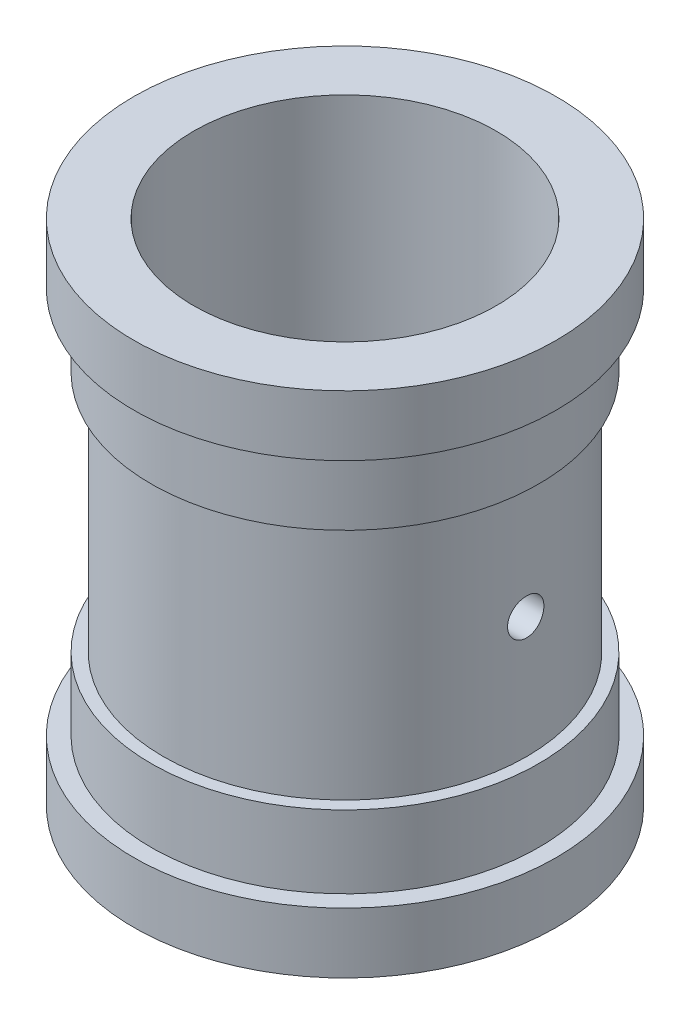
ISO-10303-21;
HEADER;
FILE_DESCRIPTION(('STEP AP214'),'2;1');
FILE_NAME('part.step','',(''),(''),'','','');
FILE_SCHEMA(('AUTOMOTIVE_DESIGN { 1 0 10303 214 1 1 1 1 }'));
ENDSEC;
DATA;
#1=APPLICATION_CONTEXT('core data for automotive mechanical design processes');
#2=APPLICATION_PROTOCOL_DEFINITION('international standard','automotive_design',2000,#1);
#3=PRODUCT_CONTEXT('',#1,'mechanical');
#4=PRODUCT('Part','Part','',(#3));
#5=PRODUCT_RELATED_PRODUCT_CATEGORY('part','',(#4));
#6=PRODUCT_DEFINITION_FORMATION('','',#4);
#7=PRODUCT_DEFINITION_CONTEXT('part definition',#1,'design');
#8=PRODUCT_DEFINITION('design','',#6,#7);
#9=PRODUCT_DEFINITION_SHAPE('','',#8);
#10=(LENGTH_UNIT() NAMED_UNIT(*) SI_UNIT(.MILLI.,.METRE.));
#11=(NAMED_UNIT(*) PLANE_ANGLE_UNIT() SI_UNIT($,.RADIAN.));
#12=(NAMED_UNIT(*) SI_UNIT($,.STERADIAN.) SOLID_ANGLE_UNIT());
#13=UNCERTAINTY_MEASURE_WITH_UNIT(LENGTH_MEASURE(1.E-05),#10,'distance_accuracy_value','');
#14=(GEOMETRIC_REPRESENTATION_CONTEXT(3) GLOBAL_UNCERTAINTY_ASSIGNED_CONTEXT((#13)) GLOBAL_UNIT_ASSIGNED_CONTEXT((#10,
#11,#12)) REPRESENTATION_CONTEXT('',''));
#15=CARTESIAN_POINT('',(0.,0.,0.));
#16=DIRECTION('',(0.,0.,1.));
#17=DIRECTION('',(1.,0.,0.));
#18=AXIS2_PLACEMENT_3D('',#15,#16,#17);
#19=CARTESIAN_POINT('',(0.,42.,0.));
#20=DIRECTION('',(0.,1.,0.));
#21=DIRECTION('',(-1.,0.,0.));
#22=AXIS2_PLACEMENT_3D('',#19,#20,#21);
#23=CYLINDRICAL_SURFACE('',#22,34.8865593644015);
#24=CARTESIAN_POINT('',(0.,42.,0.));
#25=DIRECTION('',(0.,1.,0.));
#26=DIRECTION('',(-1.,0.,0.));
#27=AXIS2_PLACEMENT_3D('',#24,#25,#26);
#28=CIRCLE('',#27,34.8865593644015);
#29=CARTESIAN_POINT('',(-34.8865593644015,42.,0.));
#30=VERTEX_POINT('',#29);
#31=EDGE_CURVE('E10',#30,#30,#28,.T.);
#32=ORIENTED_EDGE('',*,*,#31,.F.);
#33=EDGE_LOOP('',(#32));
#34=FACE_BOUND('',#33,.T.);
#35=CARTESIAN_POINT('',(0.,32.,0.));
#36=DIRECTION('',(0.,1.,0.));
#37=DIRECTION('',(-1.,0.,0.));
#38=AXIS2_PLACEMENT_3D('',#35,#36,#37);
#39=CIRCLE('',#38,34.8865593644015);
#40=CARTESIAN_POINT('',(-34.8865593644015,32.,0.));
#41=VERTEX_POINT('',#40);
#42=EDGE_CURVE('E53',#41,#41,#39,.T.);
#43=ORIENTED_EDGE('',*,*,#42,.T.);
#44=EDGE_LOOP('',(#43));
#45=FACE_BOUND('',#44,.T.);
#46=ADVANCED_FACE('F31',(#34,#45),#23,.T.);
#47=CARTESIAN_POINT('',(0.,42.,0.));
#48=DIRECTION('',(0.,-1.,0.));
#49=DIRECTION('',(1.,0.,0.));
#50=AXIS2_PLACEMENT_3D('',#47,#48,#49);
#51=PLANE('',#50);
#52=CARTESIAN_POINT('',(0.,42.,0.));
#53=DIRECTION('',(0.,1.,0.));
#54=DIRECTION('',(-1.,0.,0.));
#55=AXIS2_PLACEMENT_3D('',#52,#53,#54);
#56=CIRCLE('',#55,25.);
#57=CARTESIAN_POINT('',(-25.,42.,0.));
#58=VERTEX_POINT('',#57);
#59=EDGE_CURVE('E54',#58,#58,#56,.T.);
#60=ORIENTED_EDGE('',*,*,#59,.F.);
#61=EDGE_LOOP('',(#60));
#62=FACE_BOUND('',#61,.T.);
#63=ORIENTED_EDGE('',*,*,#31,.T.);
#64=EDGE_LOOP('',(#63));
#65=FACE_BOUND('',#64,.T.);
#66=ADVANCED_FACE('F108',(#62,#65),#51,.F.);
#67=CARTESIAN_POINT('',(0.,-42.,0.));
#68=DIRECTION('',(0.,1.,0.));
#69=DIRECTION('',(-1.,0.,0.));
#70=AXIS2_PLACEMENT_3D('',#67,#68,#69);
#71=PLANE('',#70);
#72=CARTESIAN_POINT('',(0.,-42.,0.));
#73=DIRECTION('',(0.,1.,0.));
#74=DIRECTION('',(-1.,0.,0.));
#75=AXIS2_PLACEMENT_3D('',#72,#73,#74);
#76=CIRCLE('',#75,25.);
#77=CARTESIAN_POINT('',(-25.,-42.,0.));
#78=VERTEX_POINT('',#77);
#79=EDGE_CURVE('E51',#78,#78,#76,.T.);
#80=ORIENTED_EDGE('',*,*,#79,.T.);
#81=EDGE_LOOP('',(#80));
#82=FACE_BOUND('',#81,.T.);
#83=CARTESIAN_POINT('',(0.,-42.,0.));
#84=DIRECTION('',(0.,1.,0.));
#85=DIRECTION('',(-1.,0.,0.));
#86=AXIS2_PLACEMENT_3D('',#83,#84,#85);
#87=CIRCLE('',#86,34.8865593644015);
#88=CARTESIAN_POINT('',(-34.8865593644015,-42.,0.));
#89=VERTEX_POINT('',#88);
#90=EDGE_CURVE('E42',#89,#89,#87,.T.);
#91=ORIENTED_EDGE('',*,*,#90,.F.);
#92=EDGE_LOOP('',(#91));
#93=FACE_BOUND('',#92,.T.);
#94=ADVANCED_FACE('F105',(#82,#93),#71,.F.);
#95=CARTESIAN_POINT('',(0.,42.,0.));
#96=DIRECTION('',(0.,1.,0.));
#97=DIRECTION('',(-1.,0.,0.));
#98=AXIS2_PLACEMENT_3D('',#95,#96,#97);
#99=CYLINDRICAL_SURFACE('',#98,34.8865593644015);
#100=CARTESIAN_POINT('',(0.,-32.,0.));
#101=DIRECTION('',(0.,1.,0.));
#102=DIRECTION('',(-1.,0.,0.));
#103=AXIS2_PLACEMENT_3D('',#100,#101,#102);
#104=CIRCLE('',#103,34.8865593644015);
#105=CARTESIAN_POINT('',(-34.8865593644015,-32.,0.));
#106=VERTEX_POINT('',#105);
#107=EDGE_CURVE('E47',#106,#106,#104,.T.);
#108=ORIENTED_EDGE('',*,*,#107,.F.);
#109=EDGE_LOOP('',(#108));
#110=FACE_BOUND('',#109,.T.);
#111=ORIENTED_EDGE('',*,*,#90,.T.);
#112=EDGE_LOOP('',(#111));
#113=FACE_BOUND('',#112,.T.);
#114=ADVANCED_FACE('F101',(#110,#113),#99,.T.);
#115=CARTESIAN_POINT('',(32.0000000000001,-32.,0.));
#116=DIRECTION('',(0.,-1.,0.));
#117=DIRECTION('',(1.,0.,0.));
#118=AXIS2_PLACEMENT_3D('',#115,#116,#117);
#119=PLANE('',#118);
#120=CARTESIAN_POINT('',(0.,-32.,0.));
#121=DIRECTION('',(0.,1.,0.));
#122=DIRECTION('',(-1.,0.,0.));
#123=AXIS2_PLACEMENT_3D('',#120,#121,#122);
#124=CIRCLE('',#123,32.0000000000001);
#125=CARTESIAN_POINT('',(-32.,-32.,0.));
#126=VERTEX_POINT('',#125);
#127=EDGE_CURVE('E139',#126,#126,#124,.T.);
#128=ORIENTED_EDGE('',*,*,#127,.F.);
#129=EDGE_LOOP('',(#128));
#130=FACE_BOUND('',#129,.T.);
#131=ORIENTED_EDGE('',*,*,#107,.T.);
#132=EDGE_LOOP('',(#131));
#133=FACE_BOUND('',#132,.T.);
#134=ADVANCED_FACE('F97',(#130,#133),#119,.F.);
#135=CARTESIAN_POINT('',(0.,42.,0.));
#136=DIRECTION('',(0.,1.,0.));
#137=DIRECTION('',(-1.,0.,0.));
#138=AXIS2_PLACEMENT_3D('',#135,#136,#137);
#139=CYLINDRICAL_SURFACE('',#138,32.0000000000001);
#140=CARTESIAN_POINT('',(0.,-20.,0.));
#141=DIRECTION('',(0.,1.,0.));
#142=DIRECTION('',(-1.,0.,0.));
#143=AXIS2_PLACEMENT_3D('',#140,#141,#142);
#144=CIRCLE('',#143,32.);
#145=CARTESIAN_POINT('',(-32.,-20.,0.));
#146=VERTEX_POINT('',#145);
#147=EDGE_CURVE('E136',#146,#146,#144,.T.);
#148=ORIENTED_EDGE('',*,*,#147,.F.);
#149=EDGE_LOOP('',(#148));
#150=FACE_BOUND('',#149,.T.);
#151=ORIENTED_EDGE('',*,*,#127,.T.);
#152=EDGE_LOOP('',(#151));
#153=FACE_BOUND('',#152,.T.);
#154=ADVANCED_FACE('F93',(#150,#153),#139,.T.);
#155=CARTESIAN_POINT('',(30.,-20.,0.));
#156=DIRECTION('',(0.,-1.,0.));
#157=DIRECTION('',(1.,0.,0.));
#158=AXIS2_PLACEMENT_3D('',#155,#156,#157);
#159=PLANE('',#158);
#160=CARTESIAN_POINT('',(0.,-20.,0.));
#161=DIRECTION('',(0.,1.,0.));
#162=DIRECTION('',(-1.,0.,0.));
#163=AXIS2_PLACEMENT_3D('',#160,#161,#162);
#164=CIRCLE('',#163,30.);
#165=CARTESIAN_POINT('',(-30.,-20.,0.));
#166=VERTEX_POINT('',#165);
#167=EDGE_CURVE('E133',#166,#166,#164,.T.);
#168=ORIENTED_EDGE('',*,*,#167,.F.);
#169=EDGE_LOOP('',(#168));
#170=FACE_BOUND('',#169,.T.);
#171=ORIENTED_EDGE('',*,*,#147,.T.);
#172=EDGE_LOOP('',(#171));
#173=FACE_BOUND('',#172,.T.);
#174=ADVANCED_FACE('F87',(#170,#173),#159,.F.);
#175=CARTESIAN_POINT('',(0.,42.,0.));
#176=DIRECTION('',(0.,1.,0.));
#177=DIRECTION('',(-1.,0.,0.));
#178=AXIS2_PLACEMENT_3D('',#175,#176,#177);
#179=CYLINDRICAL_SURFACE('',#178,30.);
#180=CARTESIAN_POINT('',(-30.,-3.,0.));
#181=CARTESIAN_POINT('',(-29.9999980656231,-2.99999272229886,-0.168061061374672));
#182=CARTESIAN_POINT('',(-29.9985727678862,-2.98583019331067,-0.336233235503319));
#183=CARTESIAN_POINT('',(-29.9930240278422,-2.92954688912872,-0.667915195490511));
#184=CARTESIAN_POINT('',(-29.9888976130208,-2.88739531192623,-0.831419637506484));
#185=CARTESIAN_POINT('',(-29.9784124368922,-2.7763732782065,-1.14891502636024));
#186=CARTESIAN_POINT('',(-29.9720550240213,-2.70751895844458,-1.30291165384473));
#187=CARTESIAN_POINT('',(-29.9578187218292,-2.54507727620507,-1.59712848288122));
#188=CARTESIAN_POINT('',(-29.949940135144,-2.45149483199958,-1.73735141633723));
#189=CARTESIAN_POINT('',(-29.9335123302398,-2.24189190701318,-2.00057865202225));
#190=CARTESIAN_POINT('',(-29.924961047216,-2.1258006017939,-2.12352643450468));
#191=CARTESIAN_POINT('',(-29.9081687071879,-1.87462639721091,-2.34822756429295));
#192=CARTESIAN_POINT('',(-29.8999276645476,-1.73954261987284,-2.44997993124796));
#193=CARTESIAN_POINT('',(-29.8846677465836,-1.45386440494914,-2.62960191133085));
#194=CARTESIAN_POINT('',(-29.8776515013272,-1.30323766771542,-2.70742039636464));
#195=CARTESIAN_POINT('',(-29.8656611263958,-0.990973242285062,-2.83663915422828));
#196=CARTESIAN_POINT('',(-29.8606869462667,-0.829335826248149,-2.88804007977387));
#197=CARTESIAN_POINT('',(-29.8533625221894,-0.50021459740197,-2.96279712480568));
#198=CARTESIAN_POINT('',(-29.8510035119429,-0.332752269443374,-2.98624695901139));
#199=CARTESIAN_POINT('',(-29.8491492918158,0.00374659018734347,-3.00472585540608));
#200=CARTESIAN_POINT('',(-29.8496540066624,0.17278308036618,-2.9997556646124));
#201=CARTESIAN_POINT('',(-29.8534622069681,0.506985929079957,-2.96161284075803));
#202=CARTESIAN_POINT('',(-29.8567555377196,0.672164097986084,-2.92854253237365));
#203=CARTESIAN_POINT('',(-29.8657540286226,0.994613889603284,-2.83529743245176));
#204=CARTESIAN_POINT('',(-29.8714592213548,1.1518854054751,-2.77512227476724));
#205=CARTESIAN_POINT('',(-29.8846502835622,1.45438076189667,-2.62926268164452));
#206=CARTESIAN_POINT('',(-29.8921393172448,1.59958256846795,-2.54353284815994));
#207=CARTESIAN_POINT('',(-29.9080515519864,1.87357564473565,-2.34903008205968));
#208=CARTESIAN_POINT('',(-29.9164747803836,2.00236643394529,-2.24025647500951));
#209=CARTESIAN_POINT('',(-29.9333515593897,2.24047618196708,-2.00218233723621));
#210=CARTESIAN_POINT('',(-29.94180507999,2.34970680564242,-1.87279343655409));
#211=CARTESIAN_POINT('',(-29.9577548723556,2.54491089873116,-1.59746844521134));
#212=CARTESIAN_POINT('',(-29.9652511430477,2.63088434206943,-1.4515323359988));
#213=CARTESIAN_POINT('',(-29.9784442700129,2.77713006093076,-1.14719431707709));
#214=CARTESIAN_POINT('',(-29.9841408124431,2.83739785445418,-0.988790239169708));
#215=CARTESIAN_POINT('',(-29.9930894232423,2.93045675013526,-0.664041651989794));
#216=CARTESIAN_POINT('',(-29.996341564712,2.96324867397187,-0.497697380329799));
#217=CARTESIAN_POINT('',(-30.0000255500494,3.0003129232043,-0.162555297275709));
#218=CARTESIAN_POINT('',(-30.0004694480321,3.0047071447575,0.00622890631647767));
#219=CARTESIAN_POINT('',(-29.998519252704,2.98517141085371,0.342131379947101));
#220=CARTESIAN_POINT('',(-29.9961251977341,2.96124183805416,0.509249672461411));
#221=CARTESIAN_POINT('',(-29.9887758461759,2.88583891373527,0.836724620504025));
#222=CARTESIAN_POINT('',(-29.9838258575412,2.83442263656596,0.997094546916059));
#223=CARTESIAN_POINT('',(-29.9719199658183,2.70556447788818,1.30693296415135));
#224=CARTESIAN_POINT('',(-29.9649640177577,2.62812201288181,1.45640121047135));
#225=CARTESIAN_POINT('',(-29.9497942599127,2.44910748400826,1.74074454051643));
#226=CARTESIAN_POINT('',(-29.9415763081033,2.34745533322255,1.87556897924675));
#227=CARTESIAN_POINT('',(-29.9248179860857,2.12302179677722,2.12628486993563));
#228=CARTESIAN_POINT('',(-29.9162776077892,2.00023988078905,2.24217584654753));
#229=CARTESIAN_POINT('',(-29.8998007242227,1.736500276023,2.45215832966144));
#230=CARTESIAN_POINT('',(-29.8918665041693,1.59547873037213,2.54616983603863));
#231=CARTESIAN_POINT('',(-29.8775349738267,1.29957791955994,2.70917477623148));
#232=CARTESIAN_POINT('',(-29.8711376425212,1.14469884393481,2.77816855216165));
#233=CARTESIAN_POINT('',(-29.8606184290215,0.825753781602616,2.88904562605343));
#234=CARTESIAN_POINT('',(-29.8564925534937,0.661704479726636,2.93097652443558));
#235=CARTESIAN_POINT('',(-29.8509709584863,0.328850406117682,2.98669202138839));
#236=CARTESIAN_POINT('',(-29.8495751607056,0.160045770912976,3.00047742719855));
#237=CARTESIAN_POINT('',(-29.8496733932269,-0.176732065070116,2.99949941541377));
#238=CARTESIAN_POINT('',(-29.8511547026103,-0.344705648648448,2.98486166877934));
#239=CARTESIAN_POINT('',(-29.8568131166864,-0.675794751504867,2.92771635889096));
#240=CARTESIAN_POINT('',(-29.8609902244116,-0.838910265317941,2.88520876428648));
#241=CARTESIAN_POINT('',(-29.8715660478957,-1.15565204714357,2.77356505889251));
#242=CARTESIAN_POINT('',(-29.8779644562109,-1.30927962488918,2.70443263302275));
#243=CARTESIAN_POINT('',(-29.8922625551808,-1.60277067501311,2.54151466473313));
#244=CARTESIAN_POINT('',(-29.9001622374286,-1.74263422446189,2.44772926036624));
#245=CARTESIAN_POINT('',(-29.916614616291,-2.00527102341581,2.23769566885599));
#246=CARTESIAN_POINT('',(-29.9251699418026,-2.12796922910126,2.1213538466708));
#247=CARTESIAN_POINT('',(-29.9419456418635,-2.35215669809897,1.86969509767533));
#248=CARTESIAN_POINT('',(-29.9501659356893,-2.45364087407151,1.73437363232477));
#249=CARTESIAN_POINT('',(-29.9653668620749,-2.63272036156386,1.44822430248386));
#250=CARTESIAN_POINT('',(-29.9723443208044,-2.71025487283555,1.29735824804029));
#251=CARTESIAN_POINT('',(-29.9842388774969,-2.8387872684716,0.984774837301648));
#252=CARTESIAN_POINT('',(-29.9891582972897,-2.88981507286064,0.823069949476825));
#253=CARTESIAN_POINT('',(-29.9951464132121,-2.9511618512544,0.550374784217111));
#254=CARTESIAN_POINT('',(-29.996958020755,-2.96945113289807,0.441127658533526));
#255=CARTESIAN_POINT('',(-29.9993854485236,-2.99387257818528,0.221269742451939));
#256=CARTESIAN_POINT('',(-30.0000012736808,-3.00000479196558,0.110658957679674));
#257=CARTESIAN_POINT('',(-30.,-3.,0.));
#258=B_SPLINE_CURVE_WITH_KNOTS('',3,(#180,#181,#182,#183,#184,#185,#186,#187,#188,#189,#190,
#191,#192,#193,#194,#195,#196,#197,#198,#199,#200,#201,#202,#203,#204,#205,#206,#207,#208,#209,
#210,#211,#212,#213,#214,#215,#216,#217,#218,#219,#220,#221,#222,#223,#224,#225,#226,#227,#228,
#229,#230,#231,#232,#233,#234,#235,#236,#237,#238,#239,#240,#241,#242,#243,#244,#245,#246,#247,
#248,#249,#250,#251,#252,#253,#254,#255,#256,#257),.UNSPECIFIED.,.T.,.F.,(4,2,2,2,2,2,2,2,2,2,2,
2,2,2,2,2,2,2,2,2,2,2,2,2,2,2,2,2,2,2,2,2,2,2,2,2,2,2,4),(0.,0.503779098805421,1.00811352850646,
1.51214365719661,2.01607361274835,2.52161570586883,3.02718117662117,3.53381926416665,
4.04044483327512,4.5453669613559,5.0502758176733,5.55335392323331,6.05643882484901,
6.56042284118684,7.06442160993376,7.57064202588619,8.07686300939315,8.58317222080744,
9.08946629026318,9.59358565823273,10.0976982155743,10.6007680588291,11.103849181484,
11.6086182224609,12.1133999343069,12.6199993082579,13.1265917542612,13.6322907177901,
14.1379751771876,14.6414288788187,15.1448831467812,15.648267760884,16.1516495561688,
16.6571675228296,17.1628065791087,17.6697189307873,18.1760578438588,18.5077700169705,
18.8394808220708),.UNSPECIFIED.);
#259=CARTESIAN_POINT('',(-30.,-3.,0.));
#260=VERTEX_POINT('',#259);
#261=EDGE_CURVE('E77',#260,#260,#258,.T.);
#262=ORIENTED_EDGE('',*,*,#261,.T.);
#263=EDGE_LOOP('',(#262));
#264=FACE_BOUND('',#263,.T.);
#265=CARTESIAN_POINT('',(29.8496231131986,0.,-3.));
#266=CARTESIAN_POINT('',(29.8496250836601,-0.168058692526787,-2.99999272017989));
#267=CARTESIAN_POINT('',(29.8510577086842,-0.336228505254926,-2.98583057694392));
#268=CARTESIAN_POINT('',(29.856632625566,-0.667905558898855,-2.92954894428732));
#269=CARTESIAN_POINT('',(29.8607779035211,-0.831407454116104,-2.88739864465899));
#270=CARTESIAN_POINT('',(29.8713039917369,-1.14889745764729,-2.77638034820807));
#271=CARTESIAN_POINT('',(29.8776834464882,-1.3028912681726,-2.70752854888204));
#272=CARTESIAN_POINT('',(29.8919574170702,-1.59710337687697,-2.54509280217295));
#273=CARTESIAN_POINT('',(29.8998516319073,-1.73732440345162,-2.45151376687768));
#274=CARTESIAN_POINT('',(29.9162978013197,-2.00055379097203,-2.2419142859962));
#275=CARTESIAN_POINT('',(29.9248518001641,-2.12350502851122,-2.1258222543248));
#276=CARTESIAN_POINT('',(29.9416351570655,-2.34821282701083,-1.87464514595867));
#277=CARTESIAN_POINT('',(29.9498645002548,-2.44996841821897,-1.7395592007197));
#278=CARTESIAN_POINT('',(29.9650914946698,-2.62959377102142,-1.45387908495297));
#279=CARTESIAN_POINT('',(29.9720865268399,-2.70741299638098,-1.30325298758871));
#280=CARTESIAN_POINT('',(29.9840345062727,-2.83663329944606,-0.990989952862528));
#281=CARTESIAN_POINT('',(29.9889875033118,-2.88803502110841,-0.829353284004655));
#282=CARTESIAN_POINT('',(29.9962789971309,-2.96279372805974,-0.500234348228848));
#283=CARTESIAN_POINT('',(29.9986262352846,-2.98624449824983,-0.332773581094743));
#284=CARTESIAN_POINT('',(30.0004714679608,-3.00472580740115,0.00372222206683039));
#285=CARTESIAN_POINT('',(29.9999695363582,-2.99975708323882,0.172757217163385));
#286=CARTESIAN_POINT('',(29.9961801393356,-2.96161658204953,0.506966532193681));
#287=CARTESIAN_POINT('',(29.9929026345514,-2.92854565330833,0.672152489804938));
#288=CARTESIAN_POINT('',(29.9839418779479,-2.83529661316014,0.9946175385136));
#289=CARTESIAN_POINT('',(29.9782585948786,-2.77511814963728,1.15189652687319));
#290=CARTESIAN_POINT('',(29.9651081245175,-2.62925171023668,1.45440094403876));
#291=CARTESIAN_POINT('',(29.9576378209728,-2.54351910740953,1.59960471294495));
#292=CARTESIAN_POINT('',(29.9417515355823,-2.34901042999089,1.87360053952258));
#293=CARTESIAN_POINT('',(29.9333355260044,-2.24023367956445,2.00239211568248));
#294=CARTESIAN_POINT('',(29.9164588040356,-2.00215731145906,2.24049831546807));
#295=CARTESIAN_POINT('',(29.9079980571909,-1.87276996577527,2.34972523857103));
#296=CARTESIAN_POINT('',(29.8920221978467,-1.59744940436767,2.54492260607375));
#297=CARTESIAN_POINT('',(29.884507086719,-1.45151616464357,2.63089301673867));
#298=CARTESIAN_POINT('',(29.8712726854245,-1.14717892440063,2.77713655371969));
#299=CARTESIAN_POINT('',(29.8655537739767,-0.988772302731334,2.83740426171888));
#300=CARTESIAN_POINT('',(29.8565670561282,-0.664018186155933,2.93046220691277));
#301=CARTESIAN_POINT('',(29.8532991750531,-0.497670933337665,2.9632532812291));
#302=CARTESIAN_POINT('',(29.8495974158225,-0.162527461411475,3.00031432617588));
#303=CARTESIAN_POINT('',(29.8491513464281,0.00625506079450107,3.00470698994163));
#304=CARTESIAN_POINT('',(29.8511115406432,0.34215379746859,2.98516874061408));
#305=CARTESIAN_POINT('',(29.8535177657119,0.509270034421104,2.96123821022926));
#306=CARTESIAN_POINT('',(29.8609003326721,0.836734746835025,2.88583552352256));
#307=CARTESIAN_POINT('',(29.8658712600404,0.997096713283978,2.83442138156672));
#308=CARTESIAN_POINT('',(29.8778187311639,1.30692015519092,2.70557015902782));
#309=CARTESIAN_POINT('',(29.8847953208601,1.45638138086155,2.62813248235076));
#310=CARTESIAN_POINT('',(29.8999975306715,1.74071992208633,2.44912500426965));
#311=CARTESIAN_POINT('',(29.9082273244402,1.87554582589876,2.34747389952207));
#312=CARTESIAN_POINT('',(29.9249949787556,2.12626515982219,2.12304160035352));
#313=CARTESIAN_POINT('',(29.933532846926,2.24215812102023,2.0002598827444));
#314=CARTESIAN_POINT('',(29.9499914354791,2.45214490019428,1.73651941267942));
#315=CARTESIAN_POINT('',(29.9579098216643,2.54615867875866,1.59549676790835));
#316=CARTESIAN_POINT('',(29.9722032631989,2.70916760551924,1.29959315225139));
#317=CARTESIAN_POINT('',(29.9785783396948,2.77816309652131,1.14471237128888));
#318=CARTESIAN_POINT('',(29.9890563124202,2.88904130296601,0.825768379298445));
#319=CARTESIAN_POINT('',(29.9931632581695,2.93097236197564,0.661722112949878));
#320=CARTESIAN_POINT('',(29.9986588384095,2.98668920873953,0.328874441951038));
#321=CARTESIAN_POINT('',(30.0000475492969,3.00047578750211,0.160073171076653));
#322=CARTESIAN_POINT('',(29.9999501493981,2.99950120068017,-0.176706672227239));
#323=CARTESIAN_POINT('',(29.9984765513001,2.98486428949003,-0.344685621673583));
#324=CARTESIAN_POINT('',(29.9928448073278,2.92771876302907,-0.675785665069088));
#325=CARTESIAN_POINT('',(29.9886866593462,2.88521012588109,-0.838906755205097));
#326=CARTESIAN_POINT('',(29.9781517144189,2.7735622278212,-1.15565972630323));
#327=CARTESIAN_POINT('',(29.9717752200975,2.70442659919752,-1.30929289823259));
#328=CARTESIAN_POINT('',(29.9575143724889,2.54150049324906,-1.60279380046439));
#329=CARTESIAN_POINT('',(29.9496300280248,2.44771016018664,-1.74266161130568));
#330=CARTESIAN_POINT('',(29.9331955400716,2.23767114292875,-2.00529817328082));
#331=CARTESIAN_POINT('',(29.9246427438206,2.12132995126559,-2.12799277865802));
#332=CARTESIAN_POINT('',(29.9078577230902,1.86967394536366,-2.35217327817943));
#333=CARTESIAN_POINT('',(29.8996255760349,1.73435458449278,-2.45365407554355));
#334=CARTESIAN_POINT('',(29.8843915023165,1.44820697424025,-2.63272992127215));
#335=CARTESIAN_POINT('',(29.8773927577535,1.29734015602777,-2.71026356398449));
#336=CARTESIAN_POINT('',(29.8654558428797,0.984755126261365,-2.83879412429632));
#337=CARTESIAN_POINT('',(29.8605153496223,0.823049388223102,-2.88982097366963));
#338=CARTESIAN_POINT('',(29.8545002261303,0.550356777302491,-2.95116506500055));
#339=CARTESIAN_POINT('',(29.8526799580267,0.441113246080205,-2.96945313719456));
#340=CARTESIAN_POINT('',(29.8502407553741,0.221262530872844,-2.99387297581546));
#341=CARTESIAN_POINT('',(29.8496218157822,0.110655352614086,-3.00000479327221));
#342=CARTESIAN_POINT('',(29.8496231131986,0.,-3.));
#343=B_SPLINE_CURVE_WITH_KNOTS('',3,(#265,#266,#267,#268,#269,#270,#271,#272,#273,#274,#275,
#276,#277,#278,#279,#280,#281,#282,#283,#284,#285,#286,#287,#288,#289,#290,#291,#292,#293,#294,
#295,#296,#297,#298,#299,#300,#301,#302,#303,#304,#305,#306,#307,#308,#309,#310,#311,#312,#313,
#314,#315,#316,#317,#318,#319,#320,#321,#322,#323,#324,#325,#326,#327,#328,#329,#330,#331,#332,
#333,#334,#335,#336,#337,#338,#339,#340,#341,#342),.UNSPECIFIED.,.T.,.F.,(4,2,2,2,2,2,2,2,2,2,2,
2,2,2,2,2,2,2,2,2,2,2,2,2,2,2,2,2,2,2,2,2,2,2,2,2,2,2,4),(0.,0.503771983318808,1.00809945548361,
1.51212147301073,2.01604344128225,2.52159484591606,3.02716937567589,3.53380409915705,
4.04042647225215,4.54534412697179,5.05024868996527,5.55334895457815,6.05645575444753,
6.56044636401071,7.06445175657417,7.57066275256834,8.07687448284519,8.58319287355631,
9.08949583786929,9.59360988925126,10.0977171290244,10.6007644411541,11.1038232768497,
11.6085956943698,12.1133806117144,12.6199841045618,13.1265806555584,13.6322697808491,
14.1379446934128,14.6414140040728,15.144883709918,15.6482847598757,16.1516828643423,
16.6571914511579,17.162821351054,17.6697372321326,18.1760794468383,18.5077808281997,
18.8394808171327),.UNSPECIFIED.);
#344=CARTESIAN_POINT('',(29.8496231131986,0.,-3.));
#345=VERTEX_POINT('',#344);
#346=EDGE_CURVE('E72',#345,#345,#343,.T.);
#347=ORIENTED_EDGE('',*,*,#346,.T.);
#348=EDGE_LOOP('',(#347));
#349=FACE_BOUND('',#348,.T.);
#350=CARTESIAN_POINT('',(0.,20.,0.));
#351=DIRECTION('',(0.,1.,0.));
#352=DIRECTION('',(-1.,0.,0.));
#353=AXIS2_PLACEMENT_3D('',#350,#351,#352);
#354=CIRCLE('',#353,30.);
#355=CARTESIAN_POINT('',(-30.0000000000001,20.,0.));
#356=VERTEX_POINT('',#355);
#357=EDGE_CURVE('E130',#356,#356,#354,.T.);
#358=ORIENTED_EDGE('',*,*,#357,.F.);
#359=EDGE_LOOP('',(#358));
#360=FACE_BOUND('',#359,.T.);
#361=ORIENTED_EDGE('',*,*,#167,.T.);
#362=EDGE_LOOP('',(#361));
#363=FACE_BOUND('',#362,.T.);
#364=ADVANCED_FACE('F81',(#264,#349,#360,#363),#179,.T.);
#365=CARTESIAN_POINT('',(30.,20.,0.));
#366=DIRECTION('',(0.,1.,0.));
#367=DIRECTION('',(-1.,0.,0.));
#368=AXIS2_PLACEMENT_3D('',#365,#366,#367);
#369=PLANE('',#368);
#370=CARTESIAN_POINT('',(0.,20.,0.));
#371=DIRECTION('',(0.,1.,0.));
#372=DIRECTION('',(-1.,0.,0.));
#373=AXIS2_PLACEMENT_3D('',#370,#371,#372);
#374=CIRCLE('',#373,32.);
#375=CARTESIAN_POINT('',(-32.,20.,0.));
#376=VERTEX_POINT('',#375);
#377=EDGE_CURVE('E127',#376,#376,#374,.T.);
#378=ORIENTED_EDGE('',*,*,#377,.F.);
#379=EDGE_LOOP('',(#378));
#380=FACE_BOUND('',#379,.T.);
#381=ORIENTED_EDGE('',*,*,#357,.T.);
#382=EDGE_LOOP('',(#381));
#383=FACE_BOUND('',#382,.T.);
#384=ADVANCED_FACE('F86',(#380,#383),#369,.F.);
#385=CARTESIAN_POINT('',(0.,42.,0.));
#386=DIRECTION('',(0.,1.,0.));
#387=DIRECTION('',(-1.,0.,0.));
#388=AXIS2_PLACEMENT_3D('',#385,#386,#387);
#389=CYLINDRICAL_SURFACE('',#388,32.);
#390=CARTESIAN_POINT('',(0.,32.,0.));
#391=DIRECTION('',(0.,1.,0.));
#392=DIRECTION('',(-1.,0.,0.));
#393=AXIS2_PLACEMENT_3D('',#390,#391,#392);
#394=CIRCLE('',#393,32.);
#395=CARTESIAN_POINT('',(-32.,32.,0.));
#396=VERTEX_POINT('',#395);
#397=EDGE_CURVE('E124',#396,#396,#394,.T.);
#398=ORIENTED_EDGE('',*,*,#397,.F.);
#399=EDGE_LOOP('',(#398));
#400=FACE_BOUND('',#399,.T.);
#401=ORIENTED_EDGE('',*,*,#377,.T.);
#402=EDGE_LOOP('',(#401));
#403=FACE_BOUND('',#402,.T.);
#404=ADVANCED_FACE('F157',(#400,#403),#389,.T.);
#405=CARTESIAN_POINT('',(32.,32.,0.));
#406=DIRECTION('',(0.,1.,0.));
#407=DIRECTION('',(-1.,0.,0.));
#408=AXIS2_PLACEMENT_3D('',#405,#406,#407);
#409=PLANE('',#408);
#410=ORIENTED_EDGE('',*,*,#42,.F.);
#411=EDGE_LOOP('',(#410));
#412=FACE_BOUND('',#411,.T.);
#413=ORIENTED_EDGE('',*,*,#397,.T.);
#414=EDGE_LOOP('',(#413));
#415=FACE_BOUND('',#414,.T.);
#416=ADVANCED_FACE('F163',(#412,#415),#409,.F.);
#417=CARTESIAN_POINT('',(0.,-64.0000000000001,0.));
#418=DIRECTION('',(0.,1.,0.));
#419=DIRECTION('',(-1.,0.,0.));
#420=AXIS2_PLACEMENT_3D('',#417,#418,#419);
#421=CYLINDRICAL_SURFACE('',#420,25.);
#422=CARTESIAN_POINT('',(-25.,-3.,0.));
#423=CARTESIAN_POINT('',(-24.9999977357459,-2.99999283605856,0.167864047107699));
#424=CARTESIAN_POINT('',(-24.9982914200408,-2.98586334130731,0.335834317331191));
#425=CARTESIAN_POINT('',(-24.991648705422,-2.92971893584462,0.667104571308249));
#426=CARTESIAN_POINT('',(-24.9867088933728,-2.88767455874941,0.830399429590068));
#427=CARTESIAN_POINT('',(-24.9741559265426,-2.77695372347399,1.14747479534053));
#428=CARTESIAN_POINT('',(-24.9665445315309,-2.70829479317582,1.30126148759225));
#429=CARTESIAN_POINT('',(-24.9494959264345,-2.5463312649167,1.595099157832));
#430=CARTESIAN_POINT('',(-24.9400590404141,-2.45303104024669,1.73515256713516));
#431=CARTESIAN_POINT('',(-24.920360105442,-2.24392513802476,1.99829131534451));
#432=CARTESIAN_POINT('',(-24.9100945030904,-2.12801915988808,2.1212966913072));
#433=CARTESIAN_POINT('',(-24.8899239397152,-1.8772070351121,2.34615931038342));
#434=CARTESIAN_POINT('',(-24.8800189967068,-1.74229994098135,2.44801549826473));
#435=CARTESIAN_POINT('',(-24.8616560370405,-1.45679917470162,2.62798342873896));
#436=CARTESIAN_POINT('',(-24.8532025903971,-1.30615827541986,2.7060207567257));
#437=CARTESIAN_POINT('',(-24.8387461344686,-0.993791297891255,2.8356605730156));
#438=CARTESIAN_POINT('',(-24.8327430393798,-0.832065608030697,2.88726398696776));
#439=CARTESIAN_POINT('',(-24.8239006073737,-0.502947140688578,2.96232930045399));
#440=CARTESIAN_POINT('',(-24.8210461452543,-0.335585471572324,2.98592577987646));
#441=CARTESIAN_POINT('',(-24.8187777690611,0.000744936364164081,3.0047237521967));
#442=CARTESIAN_POINT('',(-24.8193637271033,0.169713615216965,2.99992630052848));
#443=CARTESIAN_POINT('',(-24.8238961466306,0.503525964784349,2.96218316078668));
#444=CARTESIAN_POINT('',(-24.8278249434675,0.668386638680177,2.92938543222303));
#445=CARTESIAN_POINT('',(-24.8385728087608,0.99024702782136,2.83680346170067));
#446=CARTESIAN_POINT('',(-24.8453919315688,1.147246595179,2.77701871225814));
#447=CARTESIAN_POINT('',(-24.8611722079476,1.44938946823911,2.63199980699862));
#448=CARTESIAN_POINT('',(-24.8701387862198,1.59450147835355,2.54670106203925));
#449=CARTESIAN_POINT('',(-24.8891993987901,1.86840721091576,2.35312173169469));
#450=CARTESIAN_POINT('',(-24.8992934806213,1.99720024490257,2.24484017723156));
#451=CARTESIAN_POINT('',(-24.9195503308637,2.23567108436438,2.0075475556218));
#452=CARTESIAN_POINT('',(-24.929713127424,2.34522196985706,1.87840890051216));
#453=CARTESIAN_POINT('',(-24.9489020798549,2.54111152100031,1.60350795893872));
#454=CARTESIAN_POINT('',(-24.9579282334421,2.62745014001915,1.45774563908005));
#455=CARTESIAN_POINT('',(-24.9738318861702,2.77446328563966,1.15363930826285));
#456=CARTESIAN_POINT('',(-24.9807087472809,2.83513019333044,0.995291578715592));
#457=CARTESIAN_POINT('',(-24.991533065309,2.9289787378509,0.67055602227344));
#458=CARTESIAN_POINT('',(-24.9954806485584,2.96216156000448,0.504168542441624));
#459=CARTESIAN_POINT('',(-24.9999852500304,2.99993625549769,0.169174396374217));
#460=CARTESIAN_POINT('',(-25.0005630093753,3.0047030324007,0.000587720432051878));
#461=CARTESIAN_POINT('',(-24.9983187823231,2.98597142213173,-0.33498206824326));
#462=CARTESIAN_POINT('',(-24.9954968625308,2.96247358870464,-0.501965212327328));
#463=CARTESIAN_POINT('',(-24.9867833380686,2.88802503599691,-0.829074263928356));
#464=CARTESIAN_POINT('',(-24.9809010237909,2.83715738694992,-0.989219346369034));
#465=CARTESIAN_POINT('',(-24.9667255501792,2.70949929664642,-1.29870539768646));
#466=CARTESIAN_POINT('',(-24.9584323148759,2.63270803850991,-1.44804602592347));
#467=CARTESIAN_POINT('',(-24.9403085158695,2.45495708409757,-1.73246717766504));
#468=CARTESIAN_POINT('',(-24.9304708084643,2.35388386218918,-1.86747628962751));
#469=CARTESIAN_POINT('',(-24.9103817919419,2.13059915359183,-2.11867625152203));
#470=CARTESIAN_POINT('',(-24.9001304677484,2.00838689585205,-2.23486641472949));
#471=CARTESIAN_POINT('',(-24.8803059484942,1.74552438457231,-2.44574795226154));
#472=CARTESIAN_POINT('',(-24.8707365831307,1.60478098465615,-2.54032363231939));
#473=CARTESIAN_POINT('',(-24.8534214993383,1.30930497492444,-2.70449314429332));
#474=CARTESIAN_POINT('',(-24.8456757467943,1.15457262688176,-2.77408744356074));
#475=CARTESIAN_POINT('',(-24.8329105734502,0.835889391105305,-2.88612996668159));
#476=CARTESIAN_POINT('',(-24.8278845275633,0.67196198814061,-2.92864420159346));
#477=CARTESIAN_POINT('',(-24.8211085274587,0.339231030514933,-2.98553272163516));
#478=CARTESIAN_POINT('',(-24.8193584337106,0.170427683842674,-2.99990820526081));
#479=CARTESIAN_POINT('',(-24.819336326607,-0.166112729637174,-3.00009033817931));
#480=CARTESIAN_POINT('',(-24.8210421863944,-0.333849725771266,-2.98607873671351));
#481=CARTESIAN_POINT('',(-24.8276922947425,-0.664566786394168,-2.93026848672089));
#482=CARTESIAN_POINT('',(-24.8326365444657,-0.827546849175586,-2.88846982822067));
#483=CARTESIAN_POINT('',(-24.8451996524586,-1.1441045388887,-2.77832739820545));
#484=CARTESIAN_POINT('',(-24.8528177016812,-1.29768499349548,-2.70999165570539));
#485=CARTESIAN_POINT('',(-24.8698714539139,-1.5912277470701,-2.54873282628009));
#486=CARTESIAN_POINT('',(-24.8793071726153,-1.7311899284593,-2.45580952709445));
#487=CARTESIAN_POINT('',(-24.8990055122588,-1.99445294010884,-2.24733689647205));
#488=CARTESIAN_POINT('',(-24.9092728581347,-2.11764610326628,-2.1316520393015));
#489=CARTESIAN_POINT('',(-24.9294354968169,-2.342942479566,-1.88122093334447));
#490=CARTESIAN_POINT('',(-24.939330701051,-2.44504069762919,-1.74647018263601));
#491=CARTESIAN_POINT('',(-24.9576721709324,-2.62555057799886,-1.46119322465137));
#492=CARTESIAN_POINT('',(-24.966113221621,-2.70387772572229,-1.31061323462418));
#493=CARTESIAN_POINT('',(-24.9805418519727,-2.83402376444257,-0.998422751685312));
#494=CARTESIAN_POINT('',(-24.9865321180615,-2.88587169618039,-0.836824564362145));
#495=CARTESIAN_POINT('',(-24.9939268325999,-2.94906342033812,-0.561977101236697));
#496=CARTESIAN_POINT('',(-24.996193279433,-2.96813748388637,-0.450466569753487));
#497=CARTESIAN_POINT('',(-24.9992306204204,-2.99360814349096,-0.225986735693695));
#498=CARTESIAN_POINT('',(-25.0000015244492,-3.00000482325045,-0.113017442753625));
#499=CARTESIAN_POINT('',(-25.,-3.,0.));
#500=B_SPLINE_CURVE_WITH_KNOTS('',3,(#422,#423,#424,#425,#426,#427,#428,#429,#430,#431,#432,
#433,#434,#435,#436,#437,#438,#439,#440,#441,#442,#443,#444,#445,#446,#447,#448,#449,#450,#451,
#452,#453,#454,#455,#456,#457,#458,#459,#460,#461,#462,#463,#464,#465,#466,#467,#468,#469,#470,
#471,#472,#473,#474,#475,#476,#477,#478,#479,#480,#481,#482,#483,#484,#485,#486,#487,#488,#489,
#490,#491,#492,#493,#494,#495,#496,#497,#498,#499),.UNSPECIFIED.,.T.,.F.,(4,2,2,2,2,2,2,2,2,2,2,
2,2,2,2,2,2,2,2,2,2,2,2,2,2,2,2,2,2,2,2,2,2,2,2,2,2,2,4),(0.,0.503179350956159,1.00689069408623,
1.5102708637556,2.01356175441693,2.51913872195878,3.02474090904883,3.53190689496397,
4.03905511999113,4.54375638343279,5.04843888668479,5.55047092912253,6.05251241253396,
6.55583573710536,7.05918028869262,7.56572944640317,8.07227962172601,8.57898002694278,
9.08565857822619,9.58921522624226,10.0927620090108,10.5947890255775,11.0968318630167,
11.6012692178556,12.1057249760356,12.6128207581672,13.119907053063,13.6257524826489,
14.1315763666154,14.6341719319229,15.1367676776234,15.6392114771388,16.1416596143121,
16.6471952402032,17.1528504352009,17.6602829023946,18.1671576479275,18.5059342945627,
18.8447087043981),.UNSPECIFIED.);
#501=CARTESIAN_POINT('',(-25.,-3.,0.));
#502=VERTEX_POINT('',#501);
#503=EDGE_CURVE('E34',#502,#502,#500,.T.);
#504=ORIENTED_EDGE('',*,*,#503,.T.);
#505=EDGE_LOOP('',(#504));
#506=FACE_BOUND('',#505,.T.);
#507=CARTESIAN_POINT('',(24.8193472919817,0.,-3.));
#508=CARTESIAN_POINT('',(24.819349617552,0.167859141199866,-2.99999283172714));
#509=CARTESIAN_POINT('',(24.8210685774632,0.335824520149843,-2.98586413495824));
#510=CARTESIAN_POINT('',(24.8277564496116,0.667084612057878,-2.92972318709126));
#511=CARTESIAN_POINT('',(24.8327287982131,0.830374195686256,-2.88768145238964));
#512=CARTESIAN_POINT('',(24.8453523109071,1.14743840550452,-2.77696834616031));
#513=CARTESIAN_POINT('',(24.8530016988387,1.30121926113373,-2.708314627898));
#514=CARTESIAN_POINT('',(24.8701152498661,1.59504714210346,-2.5463633755789));
#515=CARTESIAN_POINT('',(24.8795790917656,1.73509659156863,-2.45307020212001));
#516=CARTESIAN_POINT('',(24.8993100054925,1.9982397716095,-2.24397143930053));
#517=CARTESIAN_POINT('',(24.9095805816582,2.12125229434842,-2.1280639725065));
#518=CARTESIAN_POINT('',(24.9297361585383,2.34612871816209,-1.87724586434875));
#519=CARTESIAN_POINT('',(24.9396211403948,2.44799158594184,-1.74233429505413));
#520=CARTESIAN_POINT('',(24.9579274023082,2.62796653293622,-1.45682956846799));
#521=CARTESIAN_POINT('',(24.9663441380671,2.70600541573962,-1.30618995384899));
#522=CARTESIAN_POINT('',(24.9807271243236,2.83564846038475,-0.993825767272774));
#523=CARTESIAN_POINT('',(24.9866934589465,2.88725352974773,-0.832101576085541));
#524=CARTESIAN_POINT('',(24.9954787324527,2.96232225610345,-0.502987856985083));
#525=CARTESIAN_POINT('',(24.9983127364408,2.98592065344577,-0.33562947104338));
#526=CARTESIAN_POINT('',(25.0005654366101,3.00472359931052,0.000694496668564786));
#527=CARTESIAN_POINT('',(24.9999842572034,2.99992918215822,0.169660019668339));
#528=CARTESIAN_POINT('',(24.9954842925266,2.96219087814864,0.503485667517529));
#529=CARTESIAN_POINT('',(24.9915826884338,2.92939189502761,0.668362437568212));
#530=CARTESIAN_POINT('',(24.9808996422381,2.836801848284,0.990254370091176));
#531=CARTESIAN_POINT('',(24.9741181490466,2.77701030581835,1.1472693930426));
#532=CARTESIAN_POINT('',(24.9584077904553,2.63197727109347,1.44943112325938));
#533=CARTESIAN_POINT('',(24.9494736188692,2.54667276399358,1.59454729727538));
#534=CARTESIAN_POINT('',(24.9304580967161,2.35308110104385,1.86845892019878));
#535=CARTESIAN_POINT('',(24.9203766976596,2.24479297358439,1.99725367876689));
#536=CARTESIAN_POINT('',(24.9001206745296,2.00749565045954,2.23571721123049));
#537=CARTESIAN_POINT('',(24.8899458632542,1.8783602186265,2.34526038878379));
#538=CARTESIAN_POINT('',(24.8707126046074,1.60346848632049,2.54113591825157));
#539=CARTESIAN_POINT('',(24.8616541602595,1.45771214083552,2.62746820730526));
#540=CARTESIAN_POINT('',(24.8456792055215,1.15360750985262,2.77447678358649));
#541=CARTESIAN_POINT('',(24.8387634934567,0.995254558742093,2.83514351157641));
#542=CARTESIAN_POINT('',(24.8278728306611,0.670507640498821,2.92899010032377));
#543=CARTESIAN_POINT('',(24.8238977496732,0.504114029880702,2.96217117858551));
#544=CARTESIAN_POINT('',(24.8193620015637,0.169116903623316,2.99993928712165));
#545=CARTESIAN_POINT('',(24.8187802560634,0.000533564118866572,3.00470284270772));
#546=CARTESIAN_POINT('',(24.8210413301146,-0.335028780842934,2.98596598055603));
#547=CARTESIAN_POINT('',(24.82388408253,-0.502007817687377,2.96246611691248));
#548=CARTESIAN_POINT('',(24.8326546274979,-0.829095783597976,2.88801791942018));
#549=CARTESIAN_POINT('',(24.8385728602158,-0.989224346809323,2.83715462498938));
#550=CARTESIAN_POINT('',(24.8528197853248,-1.29867928297596,2.70951076792624));
#551=CARTESIAN_POINT('',(24.8611485560914,-1.44800530450305,2.63272936258612));
#552=CARTESIAN_POINT('',(24.8793287313299,-1.73241629497462,2.45499302721611));
#553=CARTESIAN_POINT('',(24.8891873609855,-1.8674282868813,2.35392207141476));
#554=CARTESIAN_POINT('',(24.9092935540369,-2.11863511301179,2.13064017836707));
#555=CARTESIAN_POINT('',(24.9195411313438,-2.23482927340588,2.0084284844362));
#556=CARTESIAN_POINT('',(24.939335094491,-2.44571974723492,1.74556427266772));
#557=CARTESIAN_POINT('',(24.9488775256031,-2.54030024651142,1.60481849941783));
#558=CARTESIAN_POINT('',(24.966127243116,-2.70447820932909,1.30933642941058));
#559=CARTESIAN_POINT('',(24.9738345640038,-2.77407614237444,1.15460039564442));
#560=CARTESIAN_POINT('',(24.9865280430514,-2.8861210048758,0.835919244719989));
#561=CARTESIAN_POINT('',(24.9915209702628,-2.92863551988425,0.671998170647185));
#562=CARTESIAN_POINT('',(24.9982511364507,-2.98552674358216,0.33928058499148));
#563=CARTESIAN_POINT('',(24.9999885101567,-2.99990461669313,0.170484275461261));
#564=CARTESIAN_POINT('',(25.0000113048646,-3.00009384411233,-0.166060006255655));
#565=CARTESIAN_POINT('',(24.9983183365244,-2.98608403668324,-0.333807904658861));
#566=CARTESIAN_POINT('',(24.9917135402075,-2.93027354509751,-0.664547224796241));
#567=CARTESIAN_POINT('',(24.9868017132859,-2.88847287005041,-0.827538648089517));
#568=CARTESIAN_POINT('',(24.9743088019473,-2.77832198486848,-1.14411955598358));
#569=CARTESIAN_POINT('',(24.9667285079088,-2.70997963554577,-1.29771180874788));
#570=CARTESIAN_POINT('',(24.9497392443223,-2.54870393041534,-1.59127541052543));
#571=CARTESIAN_POINT('',(24.9403302599753,-2.45577037559617,-1.73124664929414));
#572=CARTESIAN_POINT('',(24.920663936203,-2.24728631799472,-1.99450948424813));
#573=CARTESIAN_POINT('',(24.910401817522,-2.13160264467787,-2.11769526787512));
#574=CARTESIAN_POINT('',(24.8902246865463,-1.88117696284394,-2.34297730712576));
#575=CARTESIAN_POINT('',(24.88030975725,-1.74643043548512,-2.44506854813713));
#576=CARTESIAN_POINT('',(24.8619119204259,-1.46115706384097,-2.62557074728252));
#577=CARTESIAN_POINT('',(24.8534342444192,-1.31057567177342,-2.70389598198192));
#578=CARTESIAN_POINT('',(24.8389322365013,-0.998382246295956,-2.8340380582164));
#579=CARTESIAN_POINT('',(24.8329052161653,-0.836782528814462,-2.88588396425552));
#580=CARTESIAN_POINT('',(24.8254627238532,-0.561940460888421,-2.94907010073915));
#581=CARTESIAN_POINT('',(24.8231807309863,-0.450437248037734,-2.96814164942005));
#582=CARTESIAN_POINT('',(24.8201222373143,-0.225972067868129,-2.99360896909453));
#583=CARTESIAN_POINT('',(24.8193457263061,-0.113010110440729,-3.00000482599459));
#584=CARTESIAN_POINT('',(24.8193472919817,0.,-3.));
#585=B_SPLINE_CURVE_WITH_KNOTS('',3,(#507,#508,#509,#510,#511,#512,#513,#514,#515,#516,#517,
#518,#519,#520,#521,#522,#523,#524,#525,#526,#527,#528,#529,#530,#531,#532,#533,#534,#535,#536,
#537,#538,#539,#540,#541,#542,#543,#544,#545,#546,#547,#548,#549,#550,#551,#552,#553,#554,#555,
#556,#557,#558,#559,#560,#561,#562,#563,#564,#565,#566,#567,#568,#569,#570,#571,#572,#573,#574,
#575,#576,#577,#578,#579,#580,#581,#582,#583,#584),.UNSPECIFIED.,.T.,.F.,(4,2,2,2,2,2,2,2,2,2,2,
2,2,2,2,2,2,2,2,2,2,2,2,2,2,2,2,2,2,2,2,2,2,2,2,2,2,2,4),(0.,0.503164613232923,1.00686154966524,
1.51022492507114,2.01349927674882,2.51909553323416,3.02471648549883,3.53187561756201,
4.03901733675556,4.54370917218765,5.04838262225285,5.55046046161349,6.05254720809332,
6.55588445357932,7.05924298138498,7.56577244411506,8.07230327863779,8.57902260679249,
9.08571948810824,9.58926554088957,10.0928017219916,10.5947819896887,11.0967785804672,
11.6012225031328,12.105684484956,12.6127892929794,13.119884570345,13.6257094034364,
14.1315133027652,14.6341406188081,15.1367677700954,15.6392461723566,16.1417286411941,
16.6472450412647,17.1528814752089,17.6603206216507,18.1672015841626,18.5059562893408,
18.8447086986815),.UNSPECIFIED.);
#586=CARTESIAN_POINT('',(24.8193472919817,0.,-3.));
#587=VERTEX_POINT('',#586);
#588=EDGE_CURVE('E55',#587,#587,#585,.T.);
#589=ORIENTED_EDGE('',*,*,#588,.T.);
#590=EDGE_LOOP('',(#589));
#591=FACE_BOUND('',#590,.T.);
#592=ORIENTED_EDGE('',*,*,#59,.T.);
#593=EDGE_LOOP('',(#592));
#594=FACE_BOUND('',#593,.T.);
#595=ORIENTED_EDGE('',*,*,#79,.F.);
#596=EDGE_LOOP('',(#595));
#597=FACE_BOUND('',#596,.T.);
#598=ADVANCED_FACE('F59',(#506,#591,#594,#597),#421,.F.);
#599=CARTESIAN_POINT('',(-35.,0.,0.));
#600=DIRECTION('',(1.,0.,0.));
#601=DIRECTION('',(0.,0.,-1.));
#602=AXIS2_PLACEMENT_3D('',#599,#600,#601);
#603=CYLINDRICAL_SURFACE('',#602,3.);
#604=ORIENTED_EDGE('',*,*,#588,.F.);
#605=EDGE_LOOP('',(#604));
#606=FACE_BOUND('',#605,.T.);
#607=ORIENTED_EDGE('',*,*,#346,.F.);
#608=EDGE_LOOP('',(#607));
#609=FACE_BOUND('',#608,.T.);
#610=ADVANCED_FACE('F65',(#606,#609),#603,.F.);
#611=ORIENTED_EDGE('',*,*,#503,.F.);
#612=EDGE_LOOP('',(#611));
#613=FACE_BOUND('',#612,.T.);
#614=ORIENTED_EDGE('',*,*,#261,.F.);
#615=EDGE_LOOP('',(#614));
#616=FACE_BOUND('',#615,.T.);
#617=ADVANCED_FACE('F62',(#613,#616),#603,.F.);
#618=CLOSED_SHELL('',(#46,#66,#94,#114,#134,#154,#174,#364,#384,#404,#416,#598,#610,#617));
#619=MANIFOLD_SOLID_BREP('B2',#618);
#620=ADVANCED_BREP_SHAPE_REPRESENTATION('',(#18,#619),#14);
#621=SHAPE_DEFINITION_REPRESENTATION(#9,#620);
ENDSEC;
END-ISO-10303-21;
